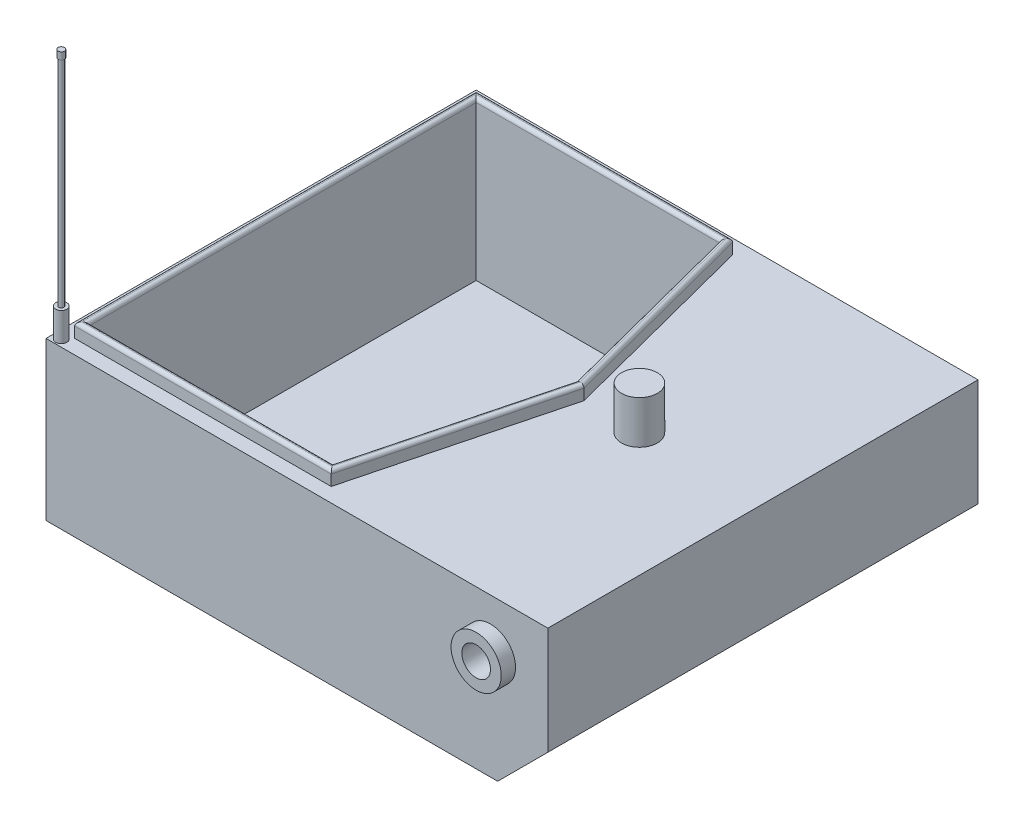
ISO-10303-21;
HEADER;
FILE_DESCRIPTION(('STEP AP214'),'2;1');
FILE_NAME('part.step','',(''),(''),'','','');
FILE_SCHEMA(('AUTOMOTIVE_DESIGN { 1 0 10303 214 1 1 1 1 }'));
ENDSEC;
DATA;
#1=APPLICATION_CONTEXT('core data for automotive mechanical design processes');
#2=APPLICATION_PROTOCOL_DEFINITION('international standard','automotive_design',2000,#1);
#3=PRODUCT_CONTEXT('',#1,'mechanical');
#4=PRODUCT('Part','Part','',(#3));
#5=PRODUCT_RELATED_PRODUCT_CATEGORY('part','',(#4));
#6=PRODUCT_DEFINITION_FORMATION('','',#4);
#7=PRODUCT_DEFINITION_CONTEXT('part definition',#1,'design');
#8=PRODUCT_DEFINITION('design','',#6,#7);
#9=PRODUCT_DEFINITION_SHAPE('','',#8);
#10=(LENGTH_UNIT() NAMED_UNIT(*) SI_UNIT(.MILLI.,.METRE.));
#11=(NAMED_UNIT(*) PLANE_ANGLE_UNIT() SI_UNIT($,.RADIAN.));
#12=(NAMED_UNIT(*) SI_UNIT($,.STERADIAN.) SOLID_ANGLE_UNIT());
#13=UNCERTAINTY_MEASURE_WITH_UNIT(LENGTH_MEASURE(1.E-05),#10,'distance_accuracy_value','');
#14=(GEOMETRIC_REPRESENTATION_CONTEXT(3) GLOBAL_UNCERTAINTY_ASSIGNED_CONTEXT((#13)) GLOBAL_UNIT_ASSIGNED_CONTEXT((#10,
#11,#12)) REPRESENTATION_CONTEXT('',''));
#15=CARTESIAN_POINT('',(0.,0.,0.));
#16=DIRECTION('',(0.,0.,1.));
#17=DIRECTION('',(1.,0.,0.));
#18=AXIS2_PLACEMENT_3D('',#15,#16,#17);
#19=CARTESIAN_POINT('',(-350.,110.,600.));
#20=DIRECTION('',(0.,-1.,0.));
#21=DIRECTION('',(0.,0.,-1.));
#22=AXIS2_PLACEMENT_3D('',#19,#20,#21);
#23=PLANE('',#22);
#24=CARTESIAN_POINT('',(-338.535261310422,110.,590.113534012745));
#25=DIRECTION('',(0.,-1.,0.));
#26=DIRECTION('',(0.,0.,-1.));
#27=AXIS2_PLACEMENT_3D('',#24,#25,#26);
#28=CIRCLE('',#27,7.84132483908817);
#29=CARTESIAN_POINT('',(-338.535261310422,110.,582.272209173657));
#30=VERTEX_POINT('',#29);
#31=EDGE_CURVE('E43',#30,#30,#28,.F.);
#32=ORIENTED_EDGE('',*,*,#31,.F.);
#33=EDGE_LOOP('',(#32));
#34=FACE_BOUND('',#33,.T.);
#35=CARTESIAN_POINT('',(177.752116483944,110.,300.));
#36=DIRECTION('',(0.,-1.,0.));
#37=DIRECTION('',(0.,0.,-1.));
#38=AXIS2_PLACEMENT_3D('',#35,#36,#37);
#39=CIRCLE('',#38,25.);
#40=CARTESIAN_POINT('',(177.752116483944,110.,275.));
#41=VERTEX_POINT('',#40);
#42=EDGE_CURVE('E269',#41,#41,#39,.F.);
#43=ORIENTED_EDGE('',*,*,#42,.F.);
#44=EDGE_LOOP('',(#43));
#45=FACE_BOUND('',#44,.T.);
#46=DIRECTION('',(-1.,0.,0.));
#47=VECTOR('',#46,1.);
#48=CARTESIAN_POINT('',(-350.,110.,0.));
#49=LINE('',#48,#47);
#50=CARTESIAN_POINT('',(350.,110.,0.));
#51=VERTEX_POINT('',#50);
#52=CARTESIAN_POINT('',(-350.,110.,0.));
#53=VERTEX_POINT('',#52);
#54=EDGE_CURVE('E288',#51,#53,#49,.T.);
#55=ORIENTED_EDGE('',*,*,#54,.T.);
#56=DIRECTION('',(0.,0.,-1.));
#57=VECTOR('',#56,1.);
#58=CARTESIAN_POINT('',(-350.,110.,600.));
#59=LINE('',#58,#57);
#60=CARTESIAN_POINT('',(-350.,110.,600.));
#61=VERTEX_POINT('',#60);
#62=EDGE_CURVE('E400',#61,#53,#59,.T.);
#63=ORIENTED_EDGE('',*,*,#62,.F.);
#64=DIRECTION('',(-1.,0.,0.));
#65=VECTOR('',#64,1.);
#66=CARTESIAN_POINT('',(-350.,110.,600.));
#67=LINE('',#66,#65);
#68=CARTESIAN_POINT('',(350.,110.,600.));
#69=VERTEX_POINT('',#68);
#70=EDGE_CURVE('E362',#69,#61,#67,.T.);
#71=ORIENTED_EDGE('',*,*,#70,.F.);
#72=DIRECTION('',(0.,0.,-1.));
#73=VECTOR('',#72,1.);
#74=CARTESIAN_POINT('',(350.,110.,600.));
#75=LINE('',#74,#73);
#76=EDGE_CURVE('E403',#69,#51,#75,.T.);
#77=ORIENTED_EDGE('',*,*,#76,.T.);
#78=EDGE_LOOP('',(#55,#63,#71,#77));
#79=FACE_BOUND('',#78,.T.);
#80=DIRECTION('',(-1.,0.,0.));
#81=VECTOR('',#80,1.);
#82=CARTESIAN_POINT('',(27.8366546211208,110.,20.));
#83=LINE('',#82,#81);
#84=CARTESIAN_POINT('',(27.8366546211208,110.,20.));
#85=VERTEX_POINT('',#84);
#86=CARTESIAN_POINT('',(-330.,110.,20.));
#87=VERTEX_POINT('',#86);
#88=EDGE_CURVE('E266',#85,#87,#83,.T.);
#89=ORIENTED_EDGE('',*,*,#88,.F.);
#90=DIRECTION('',(-0.250962158783726,0.,-0.967996898165801));
#91=VECTOR('',#90,1.);
#92=CARTESIAN_POINT('',(100.429247213713,110.,300.));
#93=LINE('',#92,#91);
#94=CARTESIAN_POINT('',(100.429247213713,110.,300.));
#95=VERTEX_POINT('',#94);
#96=EDGE_CURVE('E293',#95,#85,#93,.T.);
#97=ORIENTED_EDGE('',*,*,#96,.F.);
#98=DIRECTION('',(0.250962158783726,0.,-0.967996898165801));
#99=VECTOR('',#98,1.);
#100=CARTESIAN_POINT('',(27.8366546211209,110.,580.));
#101=LINE('',#100,#99);
#102=CARTESIAN_POINT('',(27.8366546211209,110.,580.));
#103=VERTEX_POINT('',#102);
#104=EDGE_CURVE('E302',#103,#95,#101,.T.);
#105=ORIENTED_EDGE('',*,*,#104,.F.);
#106=DIRECTION('',(1.,0.,0.));
#107=VECTOR('',#106,1.);
#108=CARTESIAN_POINT('',(-330.,110.,580.));
#109=LINE('',#108,#107);
#110=CARTESIAN_POINT('',(-330.,110.,580.));
#111=VERTEX_POINT('',#110);
#112=EDGE_CURVE('E194',#111,#103,#109,.T.);
#113=ORIENTED_EDGE('',*,*,#112,.F.);
#114=DIRECTION('',(0.,0.,1.));
#115=VECTOR('',#114,1.);
#116=CARTESIAN_POINT('',(-330.,110.,20.));
#117=LINE('',#116,#115);
#118=EDGE_CURVE('E295',#87,#111,#117,.T.);
#119=ORIENTED_EDGE('',*,*,#118,.F.);
#120=EDGE_LOOP('',(#89,#97,#105,#113,#119));
#121=FACE_BOUND('',#120,.T.);
#122=ADVANCED_FACE('F39',(#34,#45,#79,#121),#23,.F.);
#123=CARTESIAN_POINT('',(350.,-40.,600.));
#124=DIRECTION('',(-1.,0.,0.));
#125=DIRECTION('',(0.,0.,1.));
#126=AXIS2_PLACEMENT_3D('',#123,#124,#125);
#127=PLANE('',#126);
#128=DIRECTION('',(0.,1.,0.));
#129=VECTOR('',#128,1.);
#130=CARTESIAN_POINT('',(350.,-40.,0.));
#131=LINE('',#130,#129);
#132=CARTESIAN_POINT('',(350.,-40.,0.));
#133=VERTEX_POINT('',#132);
#134=EDGE_CURVE('E342',#133,#51,#131,.T.);
#135=ORIENTED_EDGE('',*,*,#134,.T.);
#136=ORIENTED_EDGE('',*,*,#76,.F.);
#137=DIRECTION('',(0.,1.,0.));
#138=VECTOR('',#137,1.);
#139=CARTESIAN_POINT('',(350.,-40.,600.));
#140=LINE('',#139,#138);
#141=CARTESIAN_POINT('',(350.,-40.,600.));
#142=VERTEX_POINT('',#141);
#143=EDGE_CURVE('E358',#142,#69,#140,.T.);
#144=ORIENTED_EDGE('',*,*,#143,.F.);
#145=DIRECTION('',(0.,0.,-1.));
#146=VECTOR('',#145,1.);
#147=CARTESIAN_POINT('',(350.,-40.,600.));
#148=LINE('',#147,#146);
#149=EDGE_CURVE('E375',#142,#133,#148,.T.);
#150=ORIENTED_EDGE('',*,*,#149,.T.);
#151=EDGE_LOOP('',(#135,#136,#144,#150));
#152=FACE_BOUND('',#151,.T.);
#153=ADVANCED_FACE('F282',(#152),#127,.F.);
#154=CARTESIAN_POINT('',(-350.,-110.,600.));
#155=DIRECTION('',(1.,0.,0.));
#156=DIRECTION('',(0.,0.,-1.));
#157=AXIS2_PLACEMENT_3D('',#154,#155,#156);
#158=PLANE('',#157);
#159=DIRECTION('',(0.,-1.,0.));
#160=VECTOR('',#159,1.);
#161=CARTESIAN_POINT('',(-350.,-110.,0.));
#162=LINE('',#161,#160);
#163=CARTESIAN_POINT('',(-350.,-110.,0.));
#164=VERTEX_POINT('',#163);
#165=EDGE_CURVE('E381',#53,#164,#162,.T.);
#166=ORIENTED_EDGE('',*,*,#165,.T.);
#167=DIRECTION('',(0.,0.,-1.));
#168=VECTOR('',#167,1.);
#169=CARTESIAN_POINT('',(-350.,-110.,600.));
#170=LINE('',#169,#168);
#171=CARTESIAN_POINT('',(-350.,-110.,600.));
#172=VERTEX_POINT('',#171);
#173=EDGE_CURVE('E396',#172,#164,#170,.T.);
#174=ORIENTED_EDGE('',*,*,#173,.F.);
#175=DIRECTION('',(0.,-1.,0.));
#176=VECTOR('',#175,1.);
#177=CARTESIAN_POINT('',(-350.,-110.,600.));
#178=LINE('',#177,#176);
#179=EDGE_CURVE('E366',#61,#172,#178,.T.);
#180=ORIENTED_EDGE('',*,*,#179,.F.);
#181=ORIENTED_EDGE('',*,*,#62,.T.);
#182=EDGE_LOOP('',(#166,#174,#180,#181));
#183=FACE_BOUND('',#182,.T.);
#184=ADVANCED_FACE('F466',(#183),#158,.F.);
#185=CARTESIAN_POINT('',(-350.,-110.,600.));
#186=DIRECTION('',(0.,1.,0.));
#187=DIRECTION('',(0.,0.,1.));
#188=AXIS2_PLACEMENT_3D('',#185,#186,#187);
#189=PLANE('',#188);
#190=DIRECTION('',(1.,0.,0.));
#191=VECTOR('',#190,1.);
#192=CARTESIAN_POINT('',(-350.,-110.,0.));
#193=LINE('',#192,#191);
#194=CARTESIAN_POINT('',(280.,-110.,0.));
#195=VERTEX_POINT('',#194);
#196=EDGE_CURVE('E384',#164,#195,#193,.T.);
#197=ORIENTED_EDGE('',*,*,#196,.T.);
#198=DIRECTION('',(0.,0.,-1.));
#199=VECTOR('',#198,1.);
#200=CARTESIAN_POINT('',(280.,-110.,600.));
#201=LINE('',#200,#199);
#202=CARTESIAN_POINT('',(280.,-110.,600.));
#203=VERTEX_POINT('',#202);
#204=EDGE_CURVE('E392',#203,#195,#201,.T.);
#205=ORIENTED_EDGE('',*,*,#204,.F.);
#206=DIRECTION('',(1.,0.,0.));
#207=VECTOR('',#206,1.);
#208=CARTESIAN_POINT('',(-350.,-110.,600.));
#209=LINE('',#208,#207);
#210=EDGE_CURVE('E369',#172,#203,#209,.T.);
#211=ORIENTED_EDGE('',*,*,#210,.F.);
#212=ORIENTED_EDGE('',*,*,#173,.T.);
#213=EDGE_LOOP('',(#197,#205,#211,#212));
#214=FACE_BOUND('',#213,.T.);
#215=ADVANCED_FACE('F471',(#214),#189,.F.);
#216=CARTESIAN_POINT('',(280.,-110.,600.));
#217=DIRECTION('',(-0.707106781186548,0.707106781186548,0.));
#218=DIRECTION('',(-0.707106781186548,-0.707106781186548,0.));
#219=AXIS2_PLACEMENT_3D('',#216,#217,#218);
#220=PLANE('',#219);
#221=DIRECTION('',(0.707106781186548,0.707106781186548,0.));
#222=VECTOR('',#221,1.);
#223=CARTESIAN_POINT('',(280.,-110.,0.));
#224=LINE('',#223,#222);
#225=EDGE_CURVE('E363',#195,#133,#224,.T.);
#226=ORIENTED_EDGE('',*,*,#225,.T.);
#227=ORIENTED_EDGE('',*,*,#149,.F.);
#228=DIRECTION('',(0.707106781186548,0.707106781186548,0.));
#229=VECTOR('',#228,1.);
#230=CARTESIAN_POINT('',(280.,-110.,600.));
#231=LINE('',#230,#229);
#232=EDGE_CURVE('E372',#203,#142,#231,.T.);
#233=ORIENTED_EDGE('',*,*,#232,.F.);
#234=ORIENTED_EDGE('',*,*,#204,.T.);
#235=EDGE_LOOP('',(#226,#227,#233,#234));
#236=FACE_BOUND('',#235,.T.);
#237=ADVANCED_FACE('F475',(#236),#220,.F.);
#238=CARTESIAN_POINT('',(0.,0.,600.));
#239=DIRECTION('',(0.,0.,-1.));
#240=DIRECTION('',(-1.,0.,0.));
#241=AXIS2_PLACEMENT_3D('',#238,#239,#240);
#242=PLANE('',#241);
#243=CARTESIAN_POINT('',(270.,40.,600.));
#244=DIRECTION('',(0.,0.,-1.));
#245=DIRECTION('',(-1.,0.,0.));
#246=AXIS2_PLACEMENT_3D('',#243,#244,#245);
#247=CIRCLE('',#246,35.);
#248=CARTESIAN_POINT('',(235.,40.,600.));
#249=VERTEX_POINT('',#248);
#250=EDGE_CURVE('E221',#249,#249,#247,.F.);
#251=ORIENTED_EDGE('',*,*,#250,.F.);
#252=EDGE_LOOP('',(#251));
#253=FACE_BOUND('',#252,.T.);
#254=ORIENTED_EDGE('',*,*,#143,.T.);
#255=ORIENTED_EDGE('',*,*,#70,.T.);
#256=ORIENTED_EDGE('',*,*,#179,.T.);
#257=ORIENTED_EDGE('',*,*,#210,.T.);
#258=ORIENTED_EDGE('',*,*,#232,.T.);
#259=EDGE_LOOP('',(#254,#255,#256,#257,#258));
#260=FACE_BOUND('',#259,.T.);
#261=ADVANCED_FACE('F479',(#253,#260),#242,.F.);
#262=CARTESIAN_POINT('',(0.,0.,0.));
#263=DIRECTION('',(0.,0.,-1.));
#264=DIRECTION('',(-1.,0.,0.));
#265=AXIS2_PLACEMENT_3D('',#262,#263,#264);
#266=PLANE('',#265);
#267=CARTESIAN_POINT('',(270.,40.,0.));
#268=DIRECTION('',(0.,0.,-1.));
#269=DIRECTION('',(-1.,0.,0.));
#270=AXIS2_PLACEMENT_3D('',#267,#268,#269);
#271=CIRCLE('',#270,35.);
#272=CARTESIAN_POINT('',(235.,40.,0.));
#273=VERTEX_POINT('',#272);
#274=EDGE_CURVE('E605',#273,#273,#271,.T.);
#275=ORIENTED_EDGE('',*,*,#274,.F.);
#276=EDGE_LOOP('',(#275));
#277=FACE_BOUND('',#276,.T.);
#278=ORIENTED_EDGE('',*,*,#134,.F.);
#279=ORIENTED_EDGE('',*,*,#225,.F.);
#280=ORIENTED_EDGE('',*,*,#196,.F.);
#281=ORIENTED_EDGE('',*,*,#165,.F.);
#282=ORIENTED_EDGE('',*,*,#54,.F.);
#283=EDGE_LOOP('',(#278,#279,#280,#281,#282));
#284=FACE_BOUND('',#283,.T.);
#285=ADVANCED_FACE('F481',(#277,#284),#266,.T.);
#286=CARTESIAN_POINT('',(27.8366546211208,130.,20.));
#287=DIRECTION('',(0.,0.,1.));
#288=DIRECTION('',(1.,0.,0.));
#289=AXIS2_PLACEMENT_3D('',#286,#287,#288);
#290=PLANE('',#289);
#291=DIRECTION('',(0.,-1.,0.));
#292=VECTOR('',#291,1.);
#293=CARTESIAN_POINT('',(-330.,130.,20.));
#294=LINE('',#293,#292);
#295=CARTESIAN_POINT('',(-330.,125.,20.));
#296=VERTEX_POINT('',#295);
#297=EDGE_CURVE('E314',#296,#87,#294,.T.);
#298=ORIENTED_EDGE('',*,*,#297,.F.);
#299=DIRECTION('',(-1.,0.,0.));
#300=VECTOR('',#299,1.);
#301=CARTESIAN_POINT('',(27.8366546211208,125.,20.));
#302=LINE('',#301,#300);
#303=CARTESIAN_POINT('',(27.8366546211208,125.,20.));
#304=VERTEX_POINT('',#303);
#305=EDGE_CURVE('E215',#296,#304,#302,.F.);
#306=ORIENTED_EDGE('',*,*,#305,.T.);
#307=DIRECTION('',(0.,-1.,0.));
#308=VECTOR('',#307,1.);
#309=CARTESIAN_POINT('',(27.8366546211208,130.,20.));
#310=LINE('',#309,#308);
#311=EDGE_CURVE('E94',#304,#85,#310,.T.);
#312=ORIENTED_EDGE('',*,*,#311,.T.);
#313=ORIENTED_EDGE('',*,*,#88,.T.);
#314=EDGE_LOOP('',(#298,#306,#312,#313));
#315=FACE_BOUND('',#314,.T.);
#316=ADVANCED_FACE('F484',(#315),#290,.F.);
#317=CARTESIAN_POINT('',(-330.,130.,20.));
#318=DIRECTION('',(1.,0.,0.));
#319=DIRECTION('',(0.,0.,-1.));
#320=AXIS2_PLACEMENT_3D('',#317,#318,#319);
#321=PLANE('',#320);
#322=DIRECTION('',(0.,-1.,0.));
#323=VECTOR('',#322,1.);
#324=CARTESIAN_POINT('',(-330.,130.,580.));
#325=LINE('',#324,#323);
#326=CARTESIAN_POINT('',(-330.,125.,580.));
#327=VERTEX_POINT('',#326);
#328=EDGE_CURVE('E196',#327,#111,#325,.T.);
#329=ORIENTED_EDGE('',*,*,#328,.F.);
#330=DIRECTION('',(0.,0.,1.));
#331=VECTOR('',#330,1.);
#332=CARTESIAN_POINT('',(-330.,125.,20.));
#333=LINE('',#332,#331);
#334=EDGE_CURVE('E58',#327,#296,#333,.F.);
#335=ORIENTED_EDGE('',*,*,#334,.T.);
#336=ORIENTED_EDGE('',*,*,#297,.T.);
#337=ORIENTED_EDGE('',*,*,#118,.T.);
#338=EDGE_LOOP('',(#329,#335,#336,#337));
#339=FACE_BOUND('',#338,.T.);
#340=ADVANCED_FACE('F515',(#339),#321,.F.);
#341=CARTESIAN_POINT('',(-330.,130.,580.));
#342=DIRECTION('',(0.,0.,-1.));
#343=DIRECTION('',(-1.,0.,0.));
#344=AXIS2_PLACEMENT_3D('',#341,#342,#343);
#345=PLANE('',#344);
#346=DIRECTION('',(0.,-1.,0.));
#347=VECTOR('',#346,1.);
#348=CARTESIAN_POINT('',(27.8366546211209,130.,580.));
#349=LINE('',#348,#347);
#350=CARTESIAN_POINT('',(27.8366546211209,125.,580.));
#351=VERTEX_POINT('',#350);
#352=EDGE_CURVE('E178',#351,#103,#349,.T.);
#353=ORIENTED_EDGE('',*,*,#352,.F.);
#354=DIRECTION('',(1.,0.,0.));
#355=VECTOR('',#354,1.);
#356=CARTESIAN_POINT('',(-330.,125.,580.));
#357=LINE('',#356,#355);
#358=EDGE_CURVE('E186',#351,#327,#357,.F.);
#359=ORIENTED_EDGE('',*,*,#358,.T.);
#360=ORIENTED_EDGE('',*,*,#328,.T.);
#361=ORIENTED_EDGE('',*,*,#112,.T.);
#362=EDGE_LOOP('',(#353,#359,#360,#361));
#363=FACE_BOUND('',#362,.T.);
#364=ADVANCED_FACE('F191',(#363),#345,.F.);
#365=CARTESIAN_POINT('',(27.8366546211209,130.,580.));
#366=DIRECTION('',(-0.967996898165801,0.,-0.250962158783726));
#367=DIRECTION('',(-0.250962158783726,0.,0.967996898165801));
#368=AXIS2_PLACEMENT_3D('',#365,#366,#367);
#369=PLANE('',#368);
#370=DIRECTION('',(0.,-1.,0.));
#371=VECTOR('',#370,1.);
#372=CARTESIAN_POINT('',(100.429247213713,130.,300.));
#373=LINE('',#372,#371);
#374=CARTESIAN_POINT('',(100.429247213713,125.,300.));
#375=VERTEX_POINT('',#374);
#376=EDGE_CURVE('E180',#375,#95,#373,.T.);
#377=ORIENTED_EDGE('',*,*,#376,.F.);
#378=DIRECTION('',(0.250962158783726,0.,-0.967996898165801));
#379=VECTOR('',#378,1.);
#380=CARTESIAN_POINT('',(27.8366546211209,125.,580.));
#381=LINE('',#380,#379);
#382=EDGE_CURVE('E174',#375,#351,#381,.F.);
#383=ORIENTED_EDGE('',*,*,#382,.T.);
#384=ORIENTED_EDGE('',*,*,#352,.T.);
#385=ORIENTED_EDGE('',*,*,#104,.T.);
#386=EDGE_LOOP('',(#377,#383,#384,#385));
#387=FACE_BOUND('',#386,.T.);
#388=ADVANCED_FACE('F176',(#387),#369,.F.);
#389=CARTESIAN_POINT('',(100.429247213713,130.,300.));
#390=DIRECTION('',(-0.967996898165801,0.,0.250962158783726));
#391=DIRECTION('',(0.250962158783726,0.,0.967996898165801));
#392=AXIS2_PLACEMENT_3D('',#389,#390,#391);
#393=PLANE('',#392);
#394=ORIENTED_EDGE('',*,*,#311,.F.);
#395=DIRECTION('',(-0.250962158783726,0.,-0.967996898165801));
#396=VECTOR('',#395,1.);
#397=CARTESIAN_POINT('',(100.429247213713,125.,300.));
#398=LINE('',#397,#396);
#399=EDGE_CURVE('E187',#304,#375,#398,.F.);
#400=ORIENTED_EDGE('',*,*,#399,.T.);
#401=ORIENTED_EDGE('',*,*,#376,.T.);
#402=ORIENTED_EDGE('',*,*,#96,.T.);
#403=EDGE_LOOP('',(#394,#400,#401,#402));
#404=FACE_BOUND('',#403,.T.);
#405=ADVANCED_FACE('F299',(#404),#393,.F.);
#406=CARTESIAN_POINT('',(0.,-90.,0.));
#407=DIRECTION('',(0.,1.,0.));
#408=DIRECTION('',(0.,0.,1.));
#409=AXIS2_PLACEMENT_3D('',#406,#407,#408);
#410=PLANE('',#409);
#411=DIRECTION('',(0.,0.,1.));
#412=VECTOR('',#411,1.);
#413=CARTESIAN_POINT('',(-320.,-90.,30.));
#414=LINE('',#413,#412);
#415=CARTESIAN_POINT('',(-320.,-90.,30.));
#416=VERTEX_POINT('',#415);
#417=CARTESIAN_POINT('',(-320.,-90.,570.));
#418=VERTEX_POINT('',#417);
#419=EDGE_CURVE('E317',#416,#418,#414,.T.);
#420=ORIENTED_EDGE('',*,*,#419,.T.);
#421=DIRECTION('',(1.,0.,0.));
#422=VECTOR('',#421,1.);
#423=CARTESIAN_POINT('',(-320.,-90.,570.));
#424=LINE('',#423,#422);
#425=CARTESIAN_POINT('',(20.0986355981717,-90.,570.));
#426=VERTEX_POINT('',#425);
#427=EDGE_CURVE('E321',#418,#426,#424,.T.);
#428=ORIENTED_EDGE('',*,*,#427,.T.);
#429=DIRECTION('',(0.250962158783726,0.,-0.967996898165801));
#430=VECTOR('',#429,1.);
#431=CARTESIAN_POINT('',(90.0986355981717,-90.,300.));
#432=LINE('',#431,#430);
#433=CARTESIAN_POINT('',(90.0986355981717,-90.,300.));
#434=VERTEX_POINT('',#433);
#435=EDGE_CURVE('E325',#426,#434,#432,.T.);
#436=ORIENTED_EDGE('',*,*,#435,.T.);
#437=DIRECTION('',(-0.250962158783726,0.,-0.967996898165801));
#438=VECTOR('',#437,1.);
#439=CARTESIAN_POINT('',(20.0986355981716,-90.,30.));
#440=LINE('',#439,#438);
#441=CARTESIAN_POINT('',(20.0986355981716,-90.,30.));
#442=VERTEX_POINT('',#441);
#443=EDGE_CURVE('E329',#434,#442,#440,.T.);
#444=ORIENTED_EDGE('',*,*,#443,.T.);
#445=DIRECTION('',(-1.,0.,0.));
#446=VECTOR('',#445,1.);
#447=CARTESIAN_POINT('',(-320.,-90.,30.));
#448=LINE('',#447,#446);
#449=EDGE_CURVE('E333',#442,#416,#448,.T.);
#450=ORIENTED_EDGE('',*,*,#449,.T.);
#451=EDGE_LOOP('',(#420,#428,#436,#444,#450));
#452=FACE_BOUND('',#451,.T.);
#453=ADVANCED_FACE('F498',(#452),#410,.T.);
#454=CARTESIAN_POINT('',(-320.,-90.,570.));
#455=DIRECTION('',(0.,0.,1.));
#456=DIRECTION('',(1.,0.,0.));
#457=AXIS2_PLACEMENT_3D('',#454,#455,#456);
#458=PLANE('',#457);
#459=DIRECTION('',(0.,1.,0.));
#460=VECTOR('',#459,1.);
#461=CARTESIAN_POINT('',(-320.,-90.,570.));
#462=LINE('',#461,#460);
#463=CARTESIAN_POINT('',(-320.,125.,570.));
#464=VERTEX_POINT('',#463);
#465=EDGE_CURVE('E337',#418,#464,#462,.T.);
#466=ORIENTED_EDGE('',*,*,#465,.T.);
#467=DIRECTION('',(1.,0.,0.));
#468=VECTOR('',#467,1.);
#469=CARTESIAN_POINT('',(20.0986355981717,125.,570.));
#470=LINE('',#469,#468);
#471=CARTESIAN_POINT('',(20.0986355981717,125.,570.));
#472=VERTEX_POINT('',#471);
#473=EDGE_CURVE('E406',#464,#472,#470,.T.);
#474=ORIENTED_EDGE('',*,*,#473,.T.);
#475=DIRECTION('',(0.,1.,0.));
#476=VECTOR('',#475,1.);
#477=CARTESIAN_POINT('',(20.0986355981717,-90.,570.));
#478=LINE('',#477,#476);
#479=EDGE_CURVE('E351',#426,#472,#478,.T.);
#480=ORIENTED_EDGE('',*,*,#479,.F.);
#481=ORIENTED_EDGE('',*,*,#427,.F.);
#482=EDGE_LOOP('',(#466,#474,#480,#481));
#483=FACE_BOUND('',#482,.T.);
#484=ADVANCED_FACE('F494',(#483),#458,.F.);
#485=CARTESIAN_POINT('',(90.0986355981717,-90.,300.));
#486=DIRECTION('',(0.967996898165801,0.,0.250962158783726));
#487=DIRECTION('',(0.250962158783726,0.,-0.967996898165801));
#488=AXIS2_PLACEMENT_3D('',#485,#486,#487);
#489=PLANE('',#488);
#490=ORIENTED_EDGE('',*,*,#479,.T.);
#491=DIRECTION('',(0.250962158783726,0.,-0.967996898165801));
#492=VECTOR('',#491,1.);
#493=CARTESIAN_POINT('',(90.0986355981717,125.,300.));
#494=LINE('',#493,#492);
#495=CARTESIAN_POINT('',(90.0986355981717,125.,300.));
#496=VERTEX_POINT('',#495);
#497=EDGE_CURVE('E410',#472,#496,#494,.T.);
#498=ORIENTED_EDGE('',*,*,#497,.T.);
#499=DIRECTION('',(0.,1.,0.));
#500=VECTOR('',#499,1.);
#501=CARTESIAN_POINT('',(90.0986355981717,-90.,300.));
#502=LINE('',#501,#500);
#503=EDGE_CURVE('E347',#434,#496,#502,.T.);
#504=ORIENTED_EDGE('',*,*,#503,.F.);
#505=ORIENTED_EDGE('',*,*,#435,.F.);
#506=EDGE_LOOP('',(#490,#498,#504,#505));
#507=FACE_BOUND('',#506,.T.);
#508=ADVANCED_FACE('F497',(#507),#489,.F.);
#509=CARTESIAN_POINT('',(20.0986355981716,-90.,30.));
#510=DIRECTION('',(0.967996898165801,0.,-0.250962158783726));
#511=DIRECTION('',(-0.250962158783726,0.,-0.967996898165801));
#512=AXIS2_PLACEMENT_3D('',#509,#510,#511);
#513=PLANE('',#512);
#514=ORIENTED_EDGE('',*,*,#503,.T.);
#515=DIRECTION('',(-0.250962158783726,0.,-0.967996898165801));
#516=VECTOR('',#515,1.);
#517=CARTESIAN_POINT('',(20.0986355981716,125.,30.));
#518=LINE('',#517,#516);
#519=CARTESIAN_POINT('',(20.0986355981716,125.,30.));
#520=VERTEX_POINT('',#519);
#521=EDGE_CURVE('E413',#496,#520,#518,.T.);
#522=ORIENTED_EDGE('',*,*,#521,.T.);
#523=DIRECTION('',(0.,1.,0.));
#524=VECTOR('',#523,1.);
#525=CARTESIAN_POINT('',(20.0986355981716,-90.,30.));
#526=LINE('',#525,#524);
#527=EDGE_CURVE('E343',#442,#520,#526,.T.);
#528=ORIENTED_EDGE('',*,*,#527,.F.);
#529=ORIENTED_EDGE('',*,*,#443,.F.);
#530=EDGE_LOOP('',(#514,#522,#528,#529));
#531=FACE_BOUND('',#530,.T.);
#532=ADVANCED_FACE('F502',(#531),#513,.F.);
#533=CARTESIAN_POINT('',(-320.,-90.,30.));
#534=DIRECTION('',(0.,0.,-1.));
#535=DIRECTION('',(-1.,0.,0.));
#536=AXIS2_PLACEMENT_3D('',#533,#534,#535);
#537=PLANE('',#536);
#538=ORIENTED_EDGE('',*,*,#527,.T.);
#539=DIRECTION('',(-1.,0.,0.));
#540=VECTOR('',#539,1.);
#541=CARTESIAN_POINT('',(-320.,125.,30.));
#542=LINE('',#541,#540);
#543=CARTESIAN_POINT('',(-320.,125.,30.));
#544=VERTEX_POINT('',#543);
#545=EDGE_CURVE('E416',#520,#544,#542,.T.);
#546=ORIENTED_EDGE('',*,*,#545,.T.);
#547=DIRECTION('',(0.,1.,0.));
#548=VECTOR('',#547,1.);
#549=CARTESIAN_POINT('',(-320.,-90.,30.));
#550=LINE('',#549,#548);
#551=EDGE_CURVE('E338',#416,#544,#550,.T.);
#552=ORIENTED_EDGE('',*,*,#551,.F.);
#553=ORIENTED_EDGE('',*,*,#449,.F.);
#554=EDGE_LOOP('',(#538,#546,#552,#553));
#555=FACE_BOUND('',#554,.T.);
#556=ADVANCED_FACE('F492',(#555),#537,.F.);
#557=CARTESIAN_POINT('',(-320.,-90.,30.));
#558=DIRECTION('',(-1.,0.,0.));
#559=DIRECTION('',(0.,0.,1.));
#560=AXIS2_PLACEMENT_3D('',#557,#558,#559);
#561=PLANE('',#560);
#562=ORIENTED_EDGE('',*,*,#551,.T.);
#563=DIRECTION('',(0.,0.,1.));
#564=VECTOR('',#563,1.);
#565=CARTESIAN_POINT('',(-320.,125.,570.));
#566=LINE('',#565,#564);
#567=EDGE_CURVE('E419',#544,#464,#566,.T.);
#568=ORIENTED_EDGE('',*,*,#567,.T.);
#569=ORIENTED_EDGE('',*,*,#465,.F.);
#570=ORIENTED_EDGE('',*,*,#419,.F.);
#571=EDGE_LOOP('',(#562,#568,#569,#570));
#572=FACE_BOUND('',#571,.T.);
#573=ADVANCED_FACE('F489',(#572),#561,.F.);
#574=CARTESIAN_POINT('',(0.,125.,25.));
#575=DIRECTION('',(1.,0.,0.));
#576=DIRECTION('',(0.,0.,-1.));
#577=AXIS2_PLACEMENT_3D('',#574,#575,#576);
#578=CYLINDRICAL_SURFACE('',#577,5.);
#579=CARTESIAN_POINT('',(23.9676451096462,125.,25.));
#580=DIRECTION('',(0.790873617837808,0.,0.611979509957757));
#581=DIRECTION('',(0.611979509957757,0.,-0.790873617837808));
#582=AXIS2_PLACEMENT_3D('',#579,#580,#581);
#583=ELLIPSE('',#582,6.32212263404315,5.);
#584=CARTESIAN_POINT('',(23.9676451096462,130.,25.));
#585=VERTEX_POINT('',#584);
#586=EDGE_CURVE('E86',#304,#585,#583,.T.);
#587=ORIENTED_EDGE('',*,*,#586,.F.);
#588=ORIENTED_EDGE('',*,*,#305,.F.);
#589=CARTESIAN_POINT('',(-325.,125.,25.));
#590=DIRECTION('',(0.707106781186547,0.,-0.707106781186548));
#591=DIRECTION('',(0.707106781186547,0.,0.707106781186547));
#592=AXIS2_PLACEMENT_3D('',#589,#590,#591);
#593=ELLIPSE('',#592,7.07106781186548,5.);
#594=CARTESIAN_POINT('',(-325.,130.,25.));
#595=VERTEX_POINT('',#594);
#596=EDGE_CURVE('E79',#595,#296,#593,.F.);
#597=ORIENTED_EDGE('',*,*,#596,.F.);
#598=DIRECTION('',(-1.,0.,0.));
#599=VECTOR('',#598,1.);
#600=CARTESIAN_POINT('',(-330.,130.,25.));
#601=LINE('',#600,#599);
#602=EDGE_CURVE('E259',#585,#595,#601,.T.);
#603=ORIENTED_EDGE('',*,*,#602,.F.);
#604=EDGE_LOOP('',(#587,#588,#597,#603));
#605=FACE_BOUND('',#604,.T.);
#606=ADVANCED_FACE('F41',(#605),#578,.T.);
#607=CARTESIAN_POINT('',(16.3848499806325,125.,-4.24792406905287));
#608=DIRECTION('',(0.250962158783726,0.,0.967996898165801));
#609=DIRECTION('',(0.967996898165801,0.,-0.250962158783726));
#610=AXIS2_PLACEMENT_3D('',#607,#608,#609);
#611=CYLINDRICAL_SURFACE('',#610,5.);
#612=ORIENTED_EDGE('',*,*,#399,.F.);
#613=ORIENTED_EDGE('',*,*,#586,.T.);
#614=DIRECTION('',(-0.250962158783726,0.,-0.967996898165801));
#615=VECTOR('',#614,1.);
#616=CARTESIAN_POINT('',(22.9966701302918,130.,21.2548107939186));
#617=LINE('',#616,#615);
#618=CARTESIAN_POINT('',(95.2639414059425,130.,300.));
#619=VERTEX_POINT('',#618);
#620=EDGE_CURVE('E251',#619,#585,#617,.T.);
#621=ORIENTED_EDGE('',*,*,#620,.F.);
#622=CARTESIAN_POINT('',(95.2639414059425,125.,300.));
#623=DIRECTION('',(0.,0.,1.));
#624=DIRECTION('',(-1.,0.,0.));
#625=AXIS2_PLACEMENT_3D('',#622,#623,#624);
#626=ELLIPSE('',#625,5.16530580777087,5.);
#627=EDGE_CURVE('E207',#375,#619,#626,.T.);
#628=ORIENTED_EDGE('',*,*,#627,.F.);
#629=EDGE_LOOP('',(#612,#613,#621,#628));
#630=FACE_BOUND('',#629,.T.);
#631=ADVANCED_FACE('F422',(#630),#611,.T.);
#632=CARTESIAN_POINT('',(-325.,125.,0.));
#633=DIRECTION('',(0.,0.,-1.));
#634=DIRECTION('',(-1.,0.,0.));
#635=AXIS2_PLACEMENT_3D('',#632,#633,#634);
#636=CYLINDRICAL_SURFACE('',#635,5.);
#637=ORIENTED_EDGE('',*,*,#596,.T.);
#638=ORIENTED_EDGE('',*,*,#334,.F.);
#639=CARTESIAN_POINT('',(-325.,125.,575.));
#640=DIRECTION('',(-0.707106781186547,0.,-0.707106781186547));
#641=DIRECTION('',(0.707106781186547,0.,-0.707106781186548));
#642=AXIS2_PLACEMENT_3D('',#639,#640,#641);
#643=ELLIPSE('',#642,7.07106781186547,5.);
#644=CARTESIAN_POINT('',(-325.,130.,575.));
#645=VERTEX_POINT('',#644);
#646=EDGE_CURVE('E208',#645,#327,#643,.F.);
#647=ORIENTED_EDGE('',*,*,#646,.F.);
#648=DIRECTION('',(0.,0.,1.));
#649=VECTOR('',#648,1.);
#650=CARTESIAN_POINT('',(-325.,130.,580.));
#651=LINE('',#650,#649);
#652=EDGE_CURVE('E243',#595,#645,#651,.T.);
#653=ORIENTED_EDGE('',*,*,#652,.F.);
#654=EDGE_LOOP('',(#637,#638,#647,#653));
#655=FACE_BOUND('',#654,.T.);
#656=ADVANCED_FACE('F441',(#655),#636,.T.);
#657=CARTESIAN_POINT('',(-320.,125.,25.));
#658=DIRECTION('',(1.,0.,0.));
#659=DIRECTION('',(0.,0.,-1.));
#660=AXIS2_PLACEMENT_3D('',#657,#658,#659);
#661=CYLINDRICAL_SURFACE('',#660,5.);
#662=CARTESIAN_POINT('',(-325.,125.,25.));
#663=DIRECTION('',(0.707106781186547,0.,-0.707106781186548));
#664=DIRECTION('',(0.707106781186547,0.,0.707106781186547));
#665=AXIS2_PLACEMENT_3D('',#662,#663,#664);
#666=ELLIPSE('',#665,7.07106781186548,5.);
#667=EDGE_CURVE('E239',#544,#595,#666,.F.);
#668=ORIENTED_EDGE('',*,*,#667,.F.);
#669=ORIENTED_EDGE('',*,*,#545,.F.);
#670=CARTESIAN_POINT('',(23.9676451096462,125.,25.));
#671=DIRECTION('',(0.790873617837808,0.,0.611979509957757));
#672=DIRECTION('',(-0.611979509957757,0.,0.790873617837808));
#673=AXIS2_PLACEMENT_3D('',#670,#671,#672);
#674=ELLIPSE('',#673,6.32212263404315,5.);
#675=EDGE_CURVE('E255',#585,#520,#674,.T.);
#676=ORIENTED_EDGE('',*,*,#675,.F.);
#677=ORIENTED_EDGE('',*,*,#602,.T.);
#678=EDGE_LOOP('',(#668,#669,#676,#677));
#679=FACE_BOUND('',#678,.T.);
#680=ADVANCED_FACE('F443',(#679),#661,.T.);
#681=CARTESIAN_POINT('',(24.9386200890006,125.,28.7451892060814));
#682=DIRECTION('',(0.250962158783726,0.,0.967996898165801));
#683=DIRECTION('',(0.967996898165801,0.,-0.250962158783726));
#684=AXIS2_PLACEMENT_3D('',#681,#682,#683);
#685=CYLINDRICAL_SURFACE('',#684,5.);
#686=ORIENTED_EDGE('',*,*,#675,.T.);
#687=ORIENTED_EDGE('',*,*,#521,.F.);
#688=CARTESIAN_POINT('',(95.2639414059426,125.,300.));
#689=DIRECTION('',(0.,0.,1.));
#690=DIRECTION('',(-1.,0.,0.));
#691=AXIS2_PLACEMENT_3D('',#688,#689,#690);
#692=ELLIPSE('',#691,5.16530580777087,5.);
#693=EDGE_CURVE('E235',#619,#496,#692,.T.);
#694=ORIENTED_EDGE('',*,*,#693,.F.);
#695=ORIENTED_EDGE('',*,*,#620,.T.);
#696=EDGE_LOOP('',(#686,#687,#694,#695));
#697=FACE_BOUND('',#696,.T.);
#698=ADVANCED_FACE('F426',(#697),#685,.T.);
#699=CARTESIAN_POINT('',(162.143204736417,125.,42.0371271538858));
#700=DIRECTION('',(-0.250962158783726,0.,0.967996898165801));
#701=DIRECTION('',(0.967996898165801,0.,0.250962158783726));
#702=AXIS2_PLACEMENT_3D('',#699,#700,#701);
#703=CYLINDRICAL_SURFACE('',#702,5.);
#704=CARTESIAN_POINT('',(23.9676451096463,125.,575.));
#705=DIRECTION('',(-0.790873617837808,0.,0.611979509957757));
#706=DIRECTION('',(-0.611979509957758,0.,-0.790873617837808));
#707=AXIS2_PLACEMENT_3D('',#704,#705,#706);
#708=ELLIPSE('',#707,6.32212263404315,5.);
#709=CARTESIAN_POINT('',(23.9676451096463,130.,575.));
#710=VERTEX_POINT('',#709);
#711=EDGE_CURVE('E199',#351,#710,#708,.T.);
#712=ORIENTED_EDGE('',*,*,#711,.F.);
#713=ORIENTED_EDGE('',*,*,#382,.F.);
#714=ORIENTED_EDGE('',*,*,#627,.T.);
#715=DIRECTION('',(0.250962158783726,0.,-0.967996898165801));
#716=VECTOR('',#715,1.);
#717=CARTESIAN_POINT('',(95.5892627228844,130.,298.745189206081));
#718=LINE('',#717,#716);
#719=EDGE_CURVE('E202',#710,#619,#718,.T.);
#720=ORIENTED_EDGE('',*,*,#719,.F.);
#721=EDGE_LOOP('',(#712,#713,#714,#720));
#722=FACE_BOUND('',#721,.T.);
#723=ADVANCED_FACE('F200',(#722),#703,.T.);
#724=CARTESIAN_POINT('',(0.,125.,575.));
#725=DIRECTION('',(-1.,0.,0.));
#726=DIRECTION('',(0.,0.,1.));
#727=AXIS2_PLACEMENT_3D('',#724,#725,#726);
#728=CYLINDRICAL_SURFACE('',#727,5.);
#729=ORIENTED_EDGE('',*,*,#358,.F.);
#730=ORIENTED_EDGE('',*,*,#711,.T.);
#731=DIRECTION('',(1.,0.,0.));
#732=VECTOR('',#731,1.);
#733=CARTESIAN_POINT('',(27.8366546211209,130.,575.));
#734=LINE('',#733,#732);
#735=EDGE_CURVE('E230',#645,#710,#734,.T.);
#736=ORIENTED_EDGE('',*,*,#735,.F.);
#737=ORIENTED_EDGE('',*,*,#646,.T.);
#738=EDGE_LOOP('',(#729,#730,#736,#737));
#739=FACE_BOUND('',#738,.T.);
#740=ADVANCED_FACE('F211',(#739),#728,.T.);
#741=CARTESIAN_POINT('',(-325.,125.,30.));
#742=DIRECTION('',(0.,0.,-1.));
#743=DIRECTION('',(-1.,0.,0.));
#744=AXIS2_PLACEMENT_3D('',#741,#742,#743);
#745=CYLINDRICAL_SURFACE('',#744,5.);
#746=ORIENTED_EDGE('',*,*,#667,.T.);
#747=ORIENTED_EDGE('',*,*,#652,.T.);
#748=CARTESIAN_POINT('',(-325.,125.,575.));
#749=DIRECTION('',(-0.707106781186547,0.,-0.707106781186547));
#750=DIRECTION('',(-0.707106781186547,0.,0.707106781186548));
#751=AXIS2_PLACEMENT_3D('',#748,#749,#750);
#752=ELLIPSE('',#751,7.07106781186547,5.);
#753=EDGE_CURVE('E225',#464,#645,#752,.F.);
#754=ORIENTED_EDGE('',*,*,#753,.F.);
#755=ORIENTED_EDGE('',*,*,#567,.F.);
#756=EDGE_LOOP('',(#746,#747,#754,#755));
#757=FACE_BOUND('',#756,.T.);
#758=ADVANCED_FACE('F437',(#757),#745,.T.);
#759=CARTESIAN_POINT('',(94.9386200890007,125.,301.254810793919));
#760=DIRECTION('',(-0.250962158783726,0.,0.967996898165801));
#761=DIRECTION('',(0.967996898165801,0.,0.250962158783726));
#762=AXIS2_PLACEMENT_3D('',#759,#760,#761);
#763=CYLINDRICAL_SURFACE('',#762,5.);
#764=ORIENTED_EDGE('',*,*,#693,.T.);
#765=ORIENTED_EDGE('',*,*,#497,.F.);
#766=CARTESIAN_POINT('',(23.9676451096462,125.,575.));
#767=DIRECTION('',(-0.790873617837808,0.,0.611979509957758));
#768=DIRECTION('',(-0.611979509957757,0.,-0.790873617837808));
#769=AXIS2_PLACEMENT_3D('',#766,#767,#768);
#770=ELLIPSE('',#769,6.32212263404315,5.);
#771=EDGE_CURVE('E222',#710,#472,#770,.T.);
#772=ORIENTED_EDGE('',*,*,#771,.F.);
#773=ORIENTED_EDGE('',*,*,#719,.T.);
#774=EDGE_LOOP('',(#764,#765,#772,#773));
#775=FACE_BOUND('',#774,.T.);
#776=ADVANCED_FACE('F430',(#775),#763,.T.);
#777=CARTESIAN_POINT('',(-320.,125.,575.));
#778=DIRECTION('',(-1.,0.,0.));
#779=DIRECTION('',(0.,0.,1.));
#780=AXIS2_PLACEMENT_3D('',#777,#778,#779);
#781=CYLINDRICAL_SURFACE('',#780,5.);
#782=ORIENTED_EDGE('',*,*,#753,.T.);
#783=ORIENTED_EDGE('',*,*,#735,.T.);
#784=ORIENTED_EDGE('',*,*,#771,.T.);
#785=ORIENTED_EDGE('',*,*,#473,.F.);
#786=EDGE_LOOP('',(#782,#783,#784,#785));
#787=FACE_BOUND('',#786,.T.);
#788=ADVANCED_FACE('F433',(#787),#781,.T.);
#789=CARTESIAN_POINT('',(270.,40.,620.));
#790=DIRECTION('',(0.,0.,-1.));
#791=DIRECTION('',(-1.,0.,0.));
#792=AXIS2_PLACEMENT_3D('',#789,#790,#791);
#793=CYLINDRICAL_SURFACE('',#792,35.);
#794=CARTESIAN_POINT('',(270.,40.,620.));
#795=DIRECTION('',(0.,0.,1.));
#796=DIRECTION('',(1.,0.,0.));
#797=AXIS2_PLACEMENT_3D('',#794,#795,#796);
#798=CIRCLE('',#797,35.);
#799=CARTESIAN_POINT('',(305.,40.,620.));
#800=VERTEX_POINT('',#799);
#801=EDGE_CURVE('E226',#800,#800,#798,.T.);
#802=ORIENTED_EDGE('',*,*,#801,.F.);
#803=EDGE_LOOP('',(#802));
#804=FACE_BOUND('',#803,.T.);
#805=ORIENTED_EDGE('',*,*,#250,.T.);
#806=EDGE_LOOP('',(#805));
#807=FACE_BOUND('',#806,.T.);
#808=ADVANCED_FACE('F464',(#804,#807),#793,.T.);
#809=CARTESIAN_POINT('',(270.,40.,620.));
#810=DIRECTION('',(0.,0.,1.));
#811=DIRECTION('',(1.,0.,0.));
#812=AXIS2_PLACEMENT_3D('',#809,#810,#811);
#813=PLANE('',#812);
#814=CARTESIAN_POINT('',(270.,40.,620.));
#815=DIRECTION('',(0.,0.,1.));
#816=DIRECTION('',(1.,0.,0.));
#817=AXIS2_PLACEMENT_3D('',#814,#815,#816);
#818=CIRCLE('',#817,20.);
#819=CARTESIAN_POINT('',(290.,40.,620.));
#820=VERTEX_POINT('',#819);
#821=EDGE_CURVE('E593',#820,#820,#818,.T.);
#822=ORIENTED_EDGE('',*,*,#821,.F.);
#823=EDGE_LOOP('',(#822));
#824=FACE_BOUND('',#823,.T.);
#825=ORIENTED_EDGE('',*,*,#801,.T.);
#826=EDGE_LOOP('',(#825));
#827=FACE_BOUND('',#826,.T.);
#828=ADVANCED_FACE('F526',(#824,#827),#813,.T.);
#829=CARTESIAN_POINT('',(270.,40.,-20.));
#830=DIRECTION('',(0.,0.,1.));
#831=DIRECTION('',(1.,0.,0.));
#832=AXIS2_PLACEMENT_3D('',#829,#830,#831);
#833=CYLINDRICAL_SURFACE('',#832,35.);
#834=CARTESIAN_POINT('',(270.,40.,-20.));
#835=DIRECTION('',(0.,0.,-1.));
#836=DIRECTION('',(-1.,0.,0.));
#837=AXIS2_PLACEMENT_3D('',#834,#835,#836);
#838=CIRCLE('',#837,35.);
#839=CARTESIAN_POINT('',(235.,40.,-20.));
#840=VERTEX_POINT('',#839);
#841=EDGE_CURVE('E606',#840,#840,#838,.T.);
#842=ORIENTED_EDGE('',*,*,#841,.F.);
#843=EDGE_LOOP('',(#842));
#844=FACE_BOUND('',#843,.T.);
#845=ORIENTED_EDGE('',*,*,#274,.T.);
#846=EDGE_LOOP('',(#845));
#847=FACE_BOUND('',#846,.T.);
#848=ADVANCED_FACE('F530',(#844,#847),#833,.T.);
#849=CARTESIAN_POINT('',(270.,40.,-20.));
#850=DIRECTION('',(0.,0.,-1.));
#851=DIRECTION('',(-1.,0.,0.));
#852=AXIS2_PLACEMENT_3D('',#849,#850,#851);
#853=PLANE('',#852);
#854=CARTESIAN_POINT('',(270.,40.,-20.));
#855=DIRECTION('',(0.,0.,1.));
#856=DIRECTION('',(1.,0.,0.));
#857=AXIS2_PLACEMENT_3D('',#854,#855,#856);
#858=CIRCLE('',#857,20.);
#859=CARTESIAN_POINT('',(290.,40.,-20.));
#860=VERTEX_POINT('',#859);
#861=EDGE_CURVE('E594',#860,#860,#858,.T.);
#862=ORIENTED_EDGE('',*,*,#861,.T.);
#863=EDGE_LOOP('',(#862));
#864=FACE_BOUND('',#863,.T.);
#865=ORIENTED_EDGE('',*,*,#841,.T.);
#866=EDGE_LOOP('',(#865));
#867=FACE_BOUND('',#866,.T.);
#868=ADVANCED_FACE('F534',(#864,#867),#853,.T.);
#869=CARTESIAN_POINT('',(177.752116483944,170.,300.));
#870=DIRECTION('',(0.,-1.,0.));
#871=DIRECTION('',(0.,0.,-1.));
#872=AXIS2_PLACEMENT_3D('',#869,#870,#871);
#873=CYLINDRICAL_SURFACE('',#872,25.);
#874=CARTESIAN_POINT('',(177.752116483944,170.,300.));
#875=DIRECTION('',(0.,1.,0.));
#876=DIRECTION('',(0.,0.,1.));
#877=AXIS2_PLACEMENT_3D('',#874,#875,#876);
#878=CIRCLE('',#877,25.);
#879=CARTESIAN_POINT('',(177.752116483944,170.,325.));
#880=VERTEX_POINT('',#879);
#881=EDGE_CURVE('E598',#880,#880,#878,.T.);
#882=ORIENTED_EDGE('',*,*,#881,.F.);
#883=EDGE_LOOP('',(#882));
#884=FACE_BOUND('',#883,.T.);
#885=ORIENTED_EDGE('',*,*,#42,.T.);
#886=EDGE_LOOP('',(#885));
#887=FACE_BOUND('',#886,.T.);
#888=ADVANCED_FACE('F538',(#884,#887),#873,.T.);
#889=CARTESIAN_POINT('',(177.752116483944,170.,300.));
#890=DIRECTION('',(0.,1.,0.));
#891=DIRECTION('',(0.,0.,1.));
#892=AXIS2_PLACEMENT_3D('',#889,#890,#891);
#893=PLANE('',#892);
#894=ORIENTED_EDGE('',*,*,#881,.T.);
#895=EDGE_LOOP('',(#894));
#896=FACE_BOUND('',#895,.T.);
#897=ADVANCED_FACE('F542',(#896),#893,.T.);
#898=CARTESIAN_POINT('',(270.,40.,-20.));
#899=DIRECTION('',(0.,0.,1.));
#900=DIRECTION('',(1.,0.,0.));
#901=AXIS2_PLACEMENT_3D('',#898,#899,#900);
#902=CYLINDRICAL_SURFACE('',#901,20.);
#903=ORIENTED_EDGE('',*,*,#861,.F.);
#904=EDGE_LOOP('',(#903));
#905=FACE_BOUND('',#904,.T.);
#906=ORIENTED_EDGE('',*,*,#821,.T.);
#907=EDGE_LOOP('',(#906));
#908=FACE_BOUND('',#907,.T.);
#909=ADVANCED_FACE('F546',(#905,#908),#902,.F.);
#910=CARTESIAN_POINT('',(-338.535261310422,150.,590.113534012745));
#911=DIRECTION('',(0.,-1.,0.));
#912=DIRECTION('',(0.,0.,-1.));
#913=AXIS2_PLACEMENT_3D('',#910,#911,#912);
#914=CYLINDRICAL_SURFACE('',#913,7.84132483908817);
#915=CARTESIAN_POINT('',(-338.535261310422,150.,590.113534012745));
#916=DIRECTION('',(0.,1.,0.));
#917=DIRECTION('',(0.,0.,1.));
#918=AXIS2_PLACEMENT_3D('',#915,#916,#917);
#919=CIRCLE('',#918,7.84132483908817);
#920=CARTESIAN_POINT('',(-338.535261310422,150.,597.954858851833));
#921=VERTEX_POINT('',#920);
#922=EDGE_CURVE('E585',#921,#921,#919,.T.);
#923=ORIENTED_EDGE('',*,*,#922,.F.);
#924=EDGE_LOOP('',(#923));
#925=FACE_BOUND('',#924,.T.);
#926=ORIENTED_EDGE('',*,*,#31,.T.);
#927=EDGE_LOOP('',(#926));
#928=FACE_BOUND('',#927,.T.);
#929=ADVANCED_FACE('F278',(#925,#928),#914,.T.);
#930=CARTESIAN_POINT('',(-338.535261310422,150.,590.113534012745));
#931=DIRECTION('',(0.,1.,0.));
#932=DIRECTION('',(0.,0.,1.));
#933=AXIS2_PLACEMENT_3D('',#930,#931,#932);
#934=PLANE('',#933);
#935=CARTESIAN_POINT('',(-338.535261310422,150.,590.113534012745));
#936=DIRECTION('',(0.,1.,0.));
#937=DIRECTION('',(0.,0.,1.));
#938=AXIS2_PLACEMENT_3D('',#935,#936,#937);
#939=CIRCLE('',#938,3.50000000000002);
#940=CARTESIAN_POINT('',(-338.535261310422,150.,593.613534012745));
#941=VERTEX_POINT('',#940);
#942=EDGE_CURVE('E11',#941,#941,#939,.T.);
#943=ORIENTED_EDGE('',*,*,#942,.F.);
#944=EDGE_LOOP('',(#943));
#945=FACE_BOUND('',#944,.T.);
#946=ORIENTED_EDGE('',*,*,#922,.T.);
#947=EDGE_LOOP('',(#946));
#948=FACE_BOUND('',#947,.T.);
#949=ADVANCED_FACE('F553',(#945,#948),#934,.T.);
#950=CARTESIAN_POINT('',(-338.535261310422,450.,590.113534012745));
#951=DIRECTION('',(0.,-1.,0.));
#952=DIRECTION('',(0.,0.,-1.));
#953=AXIS2_PLACEMENT_3D('',#950,#951,#952);
#954=CYLINDRICAL_SURFACE('',#953,3.50000000000002);
#955=CARTESIAN_POINT('',(-338.535261310422,450.,590.113534012745));
#956=DIRECTION('',(0.,1.,0.));
#957=DIRECTION('',(0.,0.,1.));
#958=AXIS2_PLACEMENT_3D('',#955,#956,#957);
#959=CIRCLE('',#958,3.50000000000002);
#960=CARTESIAN_POINT('',(-338.535261310422,450.,593.613534012745));
#961=VERTEX_POINT('',#960);
#962=EDGE_CURVE('E579',#961,#961,#959,.T.);
#963=ORIENTED_EDGE('',*,*,#962,.F.);
#964=EDGE_LOOP('',(#963));
#965=FACE_BOUND('',#964,.T.);
#966=ORIENTED_EDGE('',*,*,#942,.T.);
#967=EDGE_LOOP('',(#966));
#968=FACE_BOUND('',#967,.T.);
#969=ADVANCED_FACE('F557',(#965,#968),#954,.T.);
#970=CARTESIAN_POINT('',(-338.535261310422,460.,590.113534012745));
#971=DIRECTION('',(0.,-1.,0.));
#972=DIRECTION('',(0.,0.,-1.));
#973=AXIS2_PLACEMENT_3D('',#970,#971,#972);
#974=CYLINDRICAL_SURFACE('',#973,4.42764949909489);
#975=CARTESIAN_POINT('',(-338.535261310422,460.,590.113534012745));
#976=DIRECTION('',(0.,1.,0.));
#977=DIRECTION('',(0.,0.,1.));
#978=AXIS2_PLACEMENT_3D('',#975,#976,#977);
#979=CIRCLE('',#978,4.42764949909489);
#980=CARTESIAN_POINT('',(-338.535261310422,460.,594.54118351184));
#981=VERTEX_POINT('',#980);
#982=EDGE_CURVE('E577',#981,#981,#979,.T.);
#983=ORIENTED_EDGE('',*,*,#982,.F.);
#984=EDGE_LOOP('',(#983));
#985=FACE_BOUND('',#984,.T.);
#986=CARTESIAN_POINT('',(-338.535261310422,450.,590.113534012745));
#987=DIRECTION('',(0.,1.,0.));
#988=DIRECTION('',(0.,0.,1.));
#989=AXIS2_PLACEMENT_3D('',#986,#987,#988);
#990=CIRCLE('',#989,4.42764949909489);
#991=CARTESIAN_POINT('',(-338.535261310422,450.,594.54118351184));
#992=VERTEX_POINT('',#991);
#993=EDGE_CURVE('E580',#992,#992,#990,.T.);
#994=ORIENTED_EDGE('',*,*,#993,.T.);
#995=EDGE_LOOP('',(#994));
#996=FACE_BOUND('',#995,.T.);
#997=ADVANCED_FACE('F561',(#985,#996),#974,.T.);
#998=CARTESIAN_POINT('',(-338.535261310422,460.,590.113534012745));
#999=DIRECTION('',(0.,1.,0.));
#1000=DIRECTION('',(0.,0.,1.));
#1001=AXIS2_PLACEMENT_3D('',#998,#999,#1000);
#1002=PLANE('',#1001);
#1003=ORIENTED_EDGE('',*,*,#982,.T.);
#1004=EDGE_LOOP('',(#1003));
#1005=FACE_BOUND('',#1004,.T.);
#1006=ADVANCED_FACE('F565',(#1005),#1002,.T.);
#1007=CARTESIAN_POINT('',(-338.535261310422,450.,590.113534012745));
#1008=DIRECTION('',(0.,1.,0.));
#1009=DIRECTION('',(0.,0.,1.));
#1010=AXIS2_PLACEMENT_3D('',#1007,#1008,#1009);
#1011=PLANE('',#1010);
#1012=ORIENTED_EDGE('',*,*,#962,.T.);
#1013=EDGE_LOOP('',(#1012));
#1014=FACE_BOUND('',#1013,.T.);
#1015=ORIENTED_EDGE('',*,*,#993,.F.);
#1016=EDGE_LOOP('',(#1015));
#1017=FACE_BOUND('',#1016,.T.);
#1018=ADVANCED_FACE('F567',(#1014,#1017),#1011,.F.);
#1019=CLOSED_SHELL('',(#122,#153,#184,#215,#237,#261,#285,#316,#340,#364,#388,#405,#453,#484,
#508,#532,#556,#573,#606,#631,#656,#680,#698,#723,#740,#758,#776,#788,#808,#828,#848,#868,#888,
#897,#909,#929,#949,#969,#997,#1006,#1018));
#1020=MANIFOLD_SOLID_BREP('B2',#1019);
#1021=ADVANCED_BREP_SHAPE_REPRESENTATION('',(#18,#1020),#14);
#1022=SHAPE_DEFINITION_REPRESENTATION(#9,#1021);
ENDSEC;
END-ISO-10303-21;
